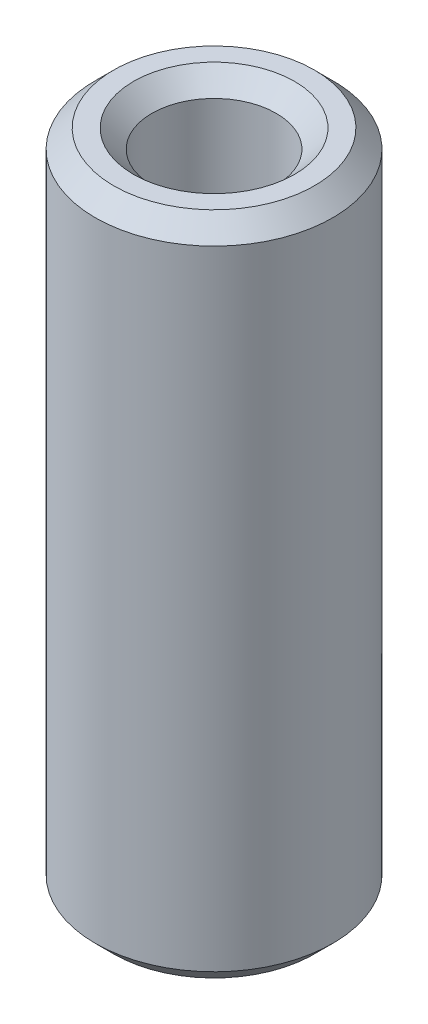
ISO-10303-21;
HEADER;
FILE_DESCRIPTION(('STEP AP214'),'2;1');
FILE_NAME('part.step','',(''),(''),'','','');
FILE_SCHEMA(('AUTOMOTIVE_DESIGN { 1 0 10303 214 1 1 1 1 }'));
ENDSEC;
DATA;
#1=APPLICATION_CONTEXT('core data for automotive mechanical design processes');
#2=APPLICATION_PROTOCOL_DEFINITION('international standard','automotive_design',2000,#1);
#3=PRODUCT_CONTEXT('',#1,'mechanical');
#4=PRODUCT('Part','Part','',(#3));
#5=PRODUCT_RELATED_PRODUCT_CATEGORY('part','',(#4));
#6=PRODUCT_DEFINITION_FORMATION('','',#4);
#7=PRODUCT_DEFINITION_CONTEXT('part definition',#1,'design');
#8=PRODUCT_DEFINITION('design','',#6,#7);
#9=PRODUCT_DEFINITION_SHAPE('','',#8);
#10=(LENGTH_UNIT() NAMED_UNIT(*) SI_UNIT(.MILLI.,.METRE.));
#11=(NAMED_UNIT(*) PLANE_ANGLE_UNIT() SI_UNIT($,.RADIAN.));
#12=(NAMED_UNIT(*) SI_UNIT($,.STERADIAN.) SOLID_ANGLE_UNIT());
#13=UNCERTAINTY_MEASURE_WITH_UNIT(LENGTH_MEASURE(1.E-05),#10,'distance_accuracy_value','');
#14=(GEOMETRIC_REPRESENTATION_CONTEXT(3) GLOBAL_UNCERTAINTY_ASSIGNED_CONTEXT((#13)) GLOBAL_UNIT_ASSIGNED_CONTEXT((#10,
#11,#12)) REPRESENTATION_CONTEXT('',''));
#15=CARTESIAN_POINT('',(0.,0.,0.));
#16=DIRECTION('',(0.,0.,1.));
#17=DIRECTION('',(1.,0.,0.));
#18=AXIS2_PLACEMENT_3D('',#15,#16,#17);
#19=CARTESIAN_POINT('',(0.,56.0164341309739,0.));
#20=DIRECTION('',(0.,-1.,0.));
#21=DIRECTION('',(0.,0.,-1.));
#22=AXIS2_PLACEMENT_3D('',#19,#20,#21);
#23=CYLINDRICAL_SURFACE('',#22,10.);
#24=CARTESIAN_POINT('',(0.,1.5511029723665,0.));
#25=DIRECTION('',(0.,1.,0.));
#26=DIRECTION('',(0.,0.,1.));
#27=AXIS2_PLACEMENT_3D('',#24,#25,#26);
#28=CIRCLE('',#27,10.);
#29=CARTESIAN_POINT('',(0.,1.5511029723665,10.));
#30=VERTEX_POINT('',#29);
#31=EDGE_CURVE('E10',#30,#30,#28,.T.);
#32=ORIENTED_EDGE('',*,*,#31,.T.);
#33=EDGE_LOOP('',(#32));
#34=FACE_BOUND('',#33,.T.);
#35=CARTESIAN_POINT('',(0.,54.4653311586074,0.));
#36=DIRECTION('',(0.,1.,0.));
#37=DIRECTION('',(0.,0.,1.));
#38=AXIS2_PLACEMENT_3D('',#35,#36,#37);
#39=CIRCLE('',#38,10.);
#40=CARTESIAN_POINT('',(0.,54.4653311586074,10.));
#41=VERTEX_POINT('',#40);
#42=EDGE_CURVE('E50',#41,#41,#39,.F.);
#43=ORIENTED_EDGE('',*,*,#42,.T.);
#44=EDGE_LOOP('',(#43));
#45=FACE_BOUND('',#44,.T.);
#46=ADVANCED_FACE('F39',(#34,#45),#23,.T.);
#47=CARTESIAN_POINT('',(0.,56.0164341309739,0.));
#48=DIRECTION('',(0.,1.,0.));
#49=DIRECTION('',(0.,0.,1.));
#50=AXIS2_PLACEMENT_3D('',#47,#48,#49);
#51=PLANE('',#50);
#52=CARTESIAN_POINT('',(0.,56.0164341309739,0.));
#53=DIRECTION('',(0.,1.,0.));
#54=DIRECTION('',(0.,0.,1.));
#55=AXIS2_PLACEMENT_3D('',#52,#53,#54);
#56=CIRCLE('',#55,6.78444020232848);
#57=CARTESIAN_POINT('',(0.,56.0164341309739,6.78444020232848));
#58=VERTEX_POINT('',#57);
#59=EDGE_CURVE('E58',#58,#58,#56,.F.);
#60=ORIENTED_EDGE('',*,*,#59,.T.);
#61=EDGE_LOOP('',(#60));
#62=FACE_BOUND('',#61,.T.);
#63=CARTESIAN_POINT('',(0.,56.0164341309739,0.));
#64=DIRECTION('',(0.,1.,0.));
#65=DIRECTION('',(0.,0.,1.));
#66=AXIS2_PLACEMENT_3D('',#63,#64,#65);
#67=CIRCLE('',#66,8.44889702763351);
#68=CARTESIAN_POINT('',(0.,56.0164341309739,8.44889702763351));
#69=VERTEX_POINT('',#68);
#70=EDGE_CURVE('E61',#69,#69,#67,.T.);
#71=ORIENTED_EDGE('',*,*,#70,.T.);
#72=EDGE_LOOP('',(#71));
#73=FACE_BOUND('',#72,.T.);
#74=ADVANCED_FACE('F88',(#62,#73),#51,.T.);
#75=CARTESIAN_POINT('',(0.,0.,0.));
#76=DIRECTION('',(0.,1.,0.));
#77=DIRECTION('',(0.,0.,1.));
#78=AXIS2_PLACEMENT_3D('',#75,#76,#77);
#79=PLANE('',#78);
#80=CARTESIAN_POINT('',(0.,0.,0.));
#81=DIRECTION('',(0.,1.,0.));
#82=DIRECTION('',(0.,0.,1.));
#83=AXIS2_PLACEMENT_3D('',#80,#81,#82);
#84=CIRCLE('',#83,6.78444020232848);
#85=CARTESIAN_POINT('',(0.,0.,-6.78444020232848));
#86=VERTEX_POINT('',#85);
#87=EDGE_CURVE('E51',#86,#86,#84,.T.);
#88=ORIENTED_EDGE('',*,*,#87,.T.);
#89=EDGE_LOOP('',(#88));
#90=FACE_BOUND('',#89,.T.);
#91=CARTESIAN_POINT('',(0.,0.,0.));
#92=DIRECTION('',(0.,1.,0.));
#93=DIRECTION('',(0.,0.,1.));
#94=AXIS2_PLACEMENT_3D('',#91,#92,#93);
#95=CIRCLE('',#94,8.4488970276335);
#96=CARTESIAN_POINT('',(0.,0.,8.4488970276335));
#97=VERTEX_POINT('',#96);
#98=EDGE_CURVE('E54',#97,#97,#95,.F.);
#99=ORIENTED_EDGE('',*,*,#98,.T.);
#100=EDGE_LOOP('',(#99));
#101=FACE_BOUND('',#100,.T.);
#102=ADVANCED_FACE('F83',(#90,#101),#79,.F.);
#103=CARTESIAN_POINT('',(0.,56.0164341309739,0.));
#104=DIRECTION('',(0.,-1.,0.));
#105=DIRECTION('',(0.,0.,-1.));
#106=AXIS2_PLACEMENT_3D('',#103,#104,#105);
#107=CYLINDRICAL_SURFACE('',#106,5.23333722996198);
#108=CARTESIAN_POINT('',(0.,54.4653311586074,0.));
#109=DIRECTION('',(0.,1.,0.));
#110=DIRECTION('',(0.,0.,1.));
#111=AXIS2_PLACEMENT_3D('',#108,#109,#110);
#112=CIRCLE('',#111,5.23333722996198);
#113=CARTESIAN_POINT('',(0.,54.4653311586074,5.23333722996198));
#114=VERTEX_POINT('',#113);
#115=EDGE_CURVE('E67',#114,#114,#112,.T.);
#116=ORIENTED_EDGE('',*,*,#115,.T.);
#117=EDGE_LOOP('',(#116));
#118=FACE_BOUND('',#117,.T.);
#119=CARTESIAN_POINT('',(0.,1.55110297236651,0.));
#120=DIRECTION('',(0.,1.,0.));
#121=DIRECTION('',(0.,0.,1.));
#122=AXIS2_PLACEMENT_3D('',#119,#120,#121);
#123=CIRCLE('',#122,5.23333722996198);
#124=CARTESIAN_POINT('',(0.,1.55110297236651,-5.23333722996198));
#125=VERTEX_POINT('',#124);
#126=EDGE_CURVE('E69',#125,#125,#123,.F.);
#127=ORIENTED_EDGE('',*,*,#126,.T.);
#128=EDGE_LOOP('',(#127));
#129=FACE_BOUND('',#128,.T.);
#130=ADVANCED_FACE('F71',(#118,#129),#107,.F.);
#131=CARTESIAN_POINT('',(0.,54.4653311586074,0.));
#132=DIRECTION('',(0.,1.,0.));
#133=DIRECTION('',(0.,0.,1.));
#134=AXIS2_PLACEMENT_3D('',#131,#132,#133);
#135=CONICAL_SURFACE('',#134,5.23333722996198,0.785398163397452);
#136=ORIENTED_EDGE('',*,*,#59,.F.);
#137=EDGE_LOOP('',(#136));
#138=FACE_BOUND('',#137,.T.);
#139=ORIENTED_EDGE('',*,*,#115,.F.);
#140=EDGE_LOOP('',(#139));
#141=FACE_BOUND('',#140,.T.);
#142=ADVANCED_FACE('F77',(#138,#141),#135,.F.);
#143=CARTESIAN_POINT('',(0.,0.,0.));
#144=DIRECTION('',(0.,-1.,0.));
#145=DIRECTION('',(0.,0.,-1.));
#146=AXIS2_PLACEMENT_3D('',#143,#144,#145);
#147=CONICAL_SURFACE('',#146,6.78444020232848,0.785398163397446);
#148=CARTESIAN_POINT('',(0.,1.55110297236651,-5.23333722996198));
#149=CARTESIAN_POINT('',(0.,1.53494564973769,-5.2494945525908));
#150=CARTESIAN_POINT('',(0.,1.51878832710888,-5.26565187521961));
#151=CARTESIAN_POINT('',(0.,1.48647368185124,-5.29796652047725));
#152=CARTESIAN_POINT('',(0.,1.47031635922242,-5.31412384310607));
#153=CARTESIAN_POINT('',(0.,1.43800171396479,-5.3464384883637));
#154=CARTESIAN_POINT('',(0.,1.42184439133597,-5.36259581099252));
#155=CARTESIAN_POINT('',(0.,1.38952974607833,-5.39491045625016));
#156=CARTESIAN_POINT('',(0.,1.37337242344952,-5.41106777887897));
#157=CARTESIAN_POINT('',(0.,1.34105777819188,-5.44338242413661));
#158=CARTESIAN_POINT('',(0.,1.32490045556306,-5.45953974676543));
#159=CARTESIAN_POINT('',(0.,1.29258581030543,-5.49185439202306));
#160=CARTESIAN_POINT('',(0.,1.27642848767661,-5.50801171465188));
#161=CARTESIAN_POINT('',(0.,1.24411384241897,-5.54032635990952));
#162=CARTESIAN_POINT('',(0.,1.22795651979016,-5.55648368253833));
#163=CARTESIAN_POINT('',(0.,1.19564187453252,-5.58879832779597));
#164=CARTESIAN_POINT('',(0.,1.1794845519037,-5.60495565042479));
#165=CARTESIAN_POINT('',(0.,1.14716990664607,-5.63727029568242));
#166=CARTESIAN_POINT('',(0.,1.13101258401725,-5.65342761831124));
#167=CARTESIAN_POINT('',(0.,1.09869793875961,-5.68574226356888));
#168=CARTESIAN_POINT('',(0.,1.08254061613079,-5.70189958619769));
#169=CARTESIAN_POINT('',(0.,1.05022597087316,-5.73421423145533));
#170=CARTESIAN_POINT('',(0.,1.03406864824434,-5.75037155408415));
#171=CARTESIAN_POINT('',(0.,1.00175400298671,-5.78268619934178));
#172=CARTESIAN_POINT('',(0.,0.985596680357888,-5.7988435219706));
#173=CARTESIAN_POINT('',(0.,0.953282035100252,-5.83115816722824));
#174=CARTESIAN_POINT('',(0.,0.937124712471434,-5.84731548985705));
#175=CARTESIAN_POINT('',(0.,0.904810067213799,-5.87963013511469));
#176=CARTESIAN_POINT('',(0.,0.888652744584981,-5.89578745774351));
#177=CARTESIAN_POINT('',(0.,0.856338099327345,-5.92810210300114));
#178=CARTESIAN_POINT('',(0.,0.840180776698528,-5.94425942562996));
#179=CARTESIAN_POINT('',(0.,0.807866131440892,-5.9765740708876));
#180=CARTESIAN_POINT('',(0.,0.791708808812074,-5.99273139351641));
#181=CARTESIAN_POINT('',(0.,0.759394163554438,-6.02504603877405));
#182=CARTESIAN_POINT('',(0.,0.74323684092562,-6.04120336140287));
#183=CARTESIAN_POINT('',(0.,0.710922195667985,-6.0735180066605));
#184=CARTESIAN_POINT('',(0.,0.694764873039167,-6.08967532928932));
#185=CARTESIAN_POINT('',(0.,0.662450227781531,-6.12198997454696));
#186=CARTESIAN_POINT('',(0.,0.646292905152713,-6.13814729717577));
#187=CARTESIAN_POINT('',(0.,0.613978259895078,-6.17046194243341));
#188=CARTESIAN_POINT('',(0.,0.59782093726626,-6.18661926506223));
#189=CARTESIAN_POINT('',(0.,0.565506292008624,-6.21893391031986));
#190=CARTESIAN_POINT('',(0.,0.549348969379806,-6.23509123294868));
#191=CARTESIAN_POINT('',(0.,0.517034324122171,-6.26740587820631));
#192=CARTESIAN_POINT('',(0.,0.500877001493353,-6.28356320083513));
#193=CARTESIAN_POINT('',(0.,0.468562356235717,-6.31587784609277));
#194=CARTESIAN_POINT('',(0.,0.452405033606899,-6.33203516872159));
#195=CARTESIAN_POINT('',(0.,0.420090388349264,-6.36434981397922));
#196=CARTESIAN_POINT('',(0.,0.403933065720446,-6.38050713660804));
#197=CARTESIAN_POINT('',(0.,0.37161842046281,-6.41282178186567));
#198=CARTESIAN_POINT('',(0.,0.355461097833992,-6.42897910449449));
#199=CARTESIAN_POINT('',(0.,0.323146452576357,-6.46129374975213));
#200=CARTESIAN_POINT('',(0.,0.306989129947539,-6.47745107238095));
#201=CARTESIAN_POINT('',(0.,0.274674484689903,-6.50976571763858));
#202=CARTESIAN_POINT('',(0.,0.258517162061085,-6.5259230402674));
#203=CARTESIAN_POINT('',(0.,0.22620251680345,-6.55823768552504));
#204=CARTESIAN_POINT('',(0.,0.210045194174632,-6.57439500815385));
#205=CARTESIAN_POINT('',(0.,0.177730548916996,-6.60670965341149));
#206=CARTESIAN_POINT('',(0.,0.161573226288178,-6.62286697604031));
#207=CARTESIAN_POINT('',(0.,0.129258581030543,-6.65518162129794));
#208=CARTESIAN_POINT('',(0.,0.113101258401725,-6.67133894392676));
#209=CARTESIAN_POINT('',(0.,0.0807866131440891,-6.70365358918439));
#210=CARTESIAN_POINT('',(0.,0.0646292905152713,-6.71981091181321));
#211=CARTESIAN_POINT('',(0.,0.0323146452576358,-6.75212555707085));
#212=CARTESIAN_POINT('',(0.,0.0161573226288181,-6.76828287969967));
#213=CARTESIAN_POINT('',(0.,0.,-6.78444020232848));
#214=B_SPLINE_CURVE_WITH_KNOTS('',3,(#148,#149,#150,#151,#152,#153,#154,#155,#156,#157,#158,
#159,#160,#161,#162,#163,#164,#165,#166,#167,#168,#169,#170,#171,#172,#173,#174,#175,#176,#177,
#178,#179,#180,#181,#182,#183,#184,#185,#186,#187,#188,#189,#190,#191,#192,#193,#194,#195,#196,
#197,#198,#199,#200,#201,#202,#203,#204,#205,#206,#207,#208,#209,#210,#211,#212,#213),
.UNSPECIFIED.,.F.,.F.,(4,2,2,2,2,2,2,2,2,2,2,2,2,2,2,2,2,2,2,2,2,2,2,2,2,2,2,2,2,2,2,2,4),(0.,
0.0685497143799358,0.137099428759871,0.205649143139806,0.274198857519742,0.342748571899677,
0.411298286279613,0.479848000659548,0.548397715039484,0.616947429419419,0.685497143799355,
0.75404685817929,0.822596572559226,0.891146286939161,0.959696001319097,1.02824571569903,
1.09679543007897,1.1653451444589,1.23389485883884,1.30244457321877,1.37099428759871,
1.43954400197865,1.50809371635858,1.57664343073852,1.64519314511845,1.71374285949839,
1.78229257387832,1.85084228825826,1.91939200263819,1.98794171701813,2.05649143139807,
2.125041145778,2.19359086015794),.UNSPECIFIED.);
#215=EDGE_CURVE('BSEAM73',#125,#86,#214,.T.);
#216=ORIENTED_EDGE('',*,*,#126,.F.);
#217=ORIENTED_EDGE('',*,*,#87,.F.);
#218=ORIENTED_EDGE('',*,*,#215,.T.);
#219=ORIENTED_EDGE('',*,*,#215,.F.);
#220=EDGE_LOOP('',(#216,#218,#217,#219));
#221=FACE_BOUND('',#220,.T.);
#222=ADVANCED_FACE('F73',(#221),#147,.F.);
#223=CARTESIAN_POINT('',(0.,1.5511029723665,0.));
#224=DIRECTION('',(0.,1.,0.));
#225=DIRECTION('',(0.,0.,1.));
#226=AXIS2_PLACEMENT_3D('',#223,#224,#225);
#227=CONICAL_SURFACE('',#226,10.,0.785398163397451);
#228=ORIENTED_EDGE('',*,*,#98,.F.);
#229=EDGE_LOOP('',(#228));
#230=FACE_BOUND('',#229,.T.);
#231=ORIENTED_EDGE('',*,*,#31,.F.);
#232=EDGE_LOOP('',(#231));
#233=FACE_BOUND('',#232,.T.);
#234=ADVANCED_FACE('F76',(#230,#233),#227,.T.);
#235=CARTESIAN_POINT('',(0.,56.0164341309739,0.));
#236=DIRECTION('',(0.,-1.,0.));
#237=DIRECTION('',(0.,0.,-1.));
#238=AXIS2_PLACEMENT_3D('',#235,#236,#237);
#239=CONICAL_SURFACE('',#238,8.44889702763351,0.78539816339745);
#240=ORIENTED_EDGE('',*,*,#42,.F.);
#241=EDGE_LOOP('',(#240));
#242=FACE_BOUND('',#241,.T.);
#243=ORIENTED_EDGE('',*,*,#70,.F.);
#244=EDGE_LOOP('',(#243));
#245=FACE_BOUND('',#244,.T.);
#246=ADVANCED_FACE('F45',(#242,#245),#239,.T.);
#247=CLOSED_SHELL('',(#46,#74,#102,#130,#142,#222,#234,#246));
#248=MANIFOLD_SOLID_BREP('B2',#247);
#249=ADVANCED_BREP_SHAPE_REPRESENTATION('',(#18,#248),#14);
#250=SHAPE_DEFINITION_REPRESENTATION(#9,#249);
ENDSEC;
END-ISO-10303-21;
